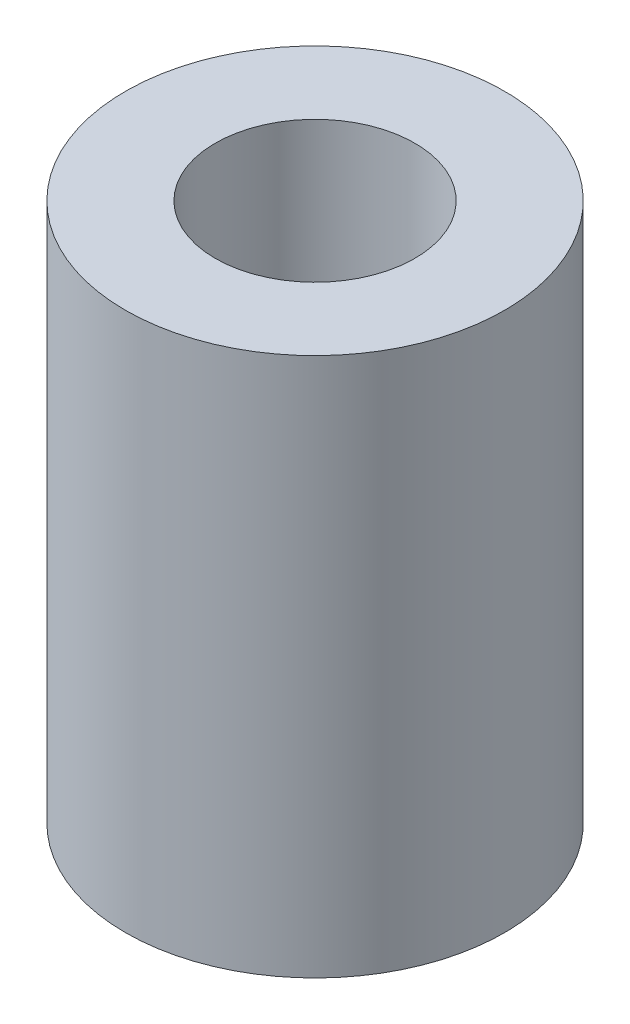
ISO-10303-21;
HEADER;
FILE_DESCRIPTION(('STEP AP214'),'2;1');
FILE_NAME('part.step','',(''),(''),'','','');
FILE_SCHEMA(('AUTOMOTIVE_DESIGN { 1 0 10303 214 1 1 1 1 }'));
ENDSEC;
DATA;
#1=APPLICATION_CONTEXT('core data for automotive mechanical design processes');
#2=APPLICATION_PROTOCOL_DEFINITION('international standard','automotive_design',2000,#1);
#3=PRODUCT_CONTEXT('',#1,'mechanical');
#4=PRODUCT('Part','Part','',(#3));
#5=PRODUCT_RELATED_PRODUCT_CATEGORY('part','',(#4));
#6=PRODUCT_DEFINITION_FORMATION('','',#4);
#7=PRODUCT_DEFINITION_CONTEXT('part definition',#1,'design');
#8=PRODUCT_DEFINITION('design','',#6,#7);
#9=PRODUCT_DEFINITION_SHAPE('','',#8);
#10=(LENGTH_UNIT() NAMED_UNIT(*) SI_UNIT(.MILLI.,.METRE.));
#11=(NAMED_UNIT(*) PLANE_ANGLE_UNIT() SI_UNIT($,.RADIAN.));
#12=(NAMED_UNIT(*) SI_UNIT($,.STERADIAN.) SOLID_ANGLE_UNIT());
#13=UNCERTAINTY_MEASURE_WITH_UNIT(LENGTH_MEASURE(1.E-05),#10,'distance_accuracy_value','');
#14=(GEOMETRIC_REPRESENTATION_CONTEXT(3) GLOBAL_UNCERTAINTY_ASSIGNED_CONTEXT((#13)) GLOBAL_UNIT_ASSIGNED_CONTEXT((#10,
#11,#12)) REPRESENTATION_CONTEXT('',''));
#15=CARTESIAN_POINT('',(0.,0.,0.));
#16=DIRECTION('',(0.,0.,1.));
#17=DIRECTION('',(1.,0.,0.));
#18=AXIS2_PLACEMENT_3D('',#15,#16,#17);
#19=CARTESIAN_POINT('',(0.,13.5,0.));
#20=DIRECTION('',(0.,-1.,0.));
#21=DIRECTION('',(0.,0.,-1.));
#22=AXIS2_PLACEMENT_3D('',#19,#20,#21);
#23=CYLINDRICAL_SURFACE('',#22,4.75);
#24=CARTESIAN_POINT('',(0.,13.5,0.));
#25=DIRECTION('',(0.,1.,0.));
#26=DIRECTION('',(0.,0.,1.));
#27=AXIS2_PLACEMENT_3D('',#24,#25,#26);
#28=CIRCLE('',#27,4.75);
#29=CARTESIAN_POINT('',(0.,13.5,4.75));
#30=VERTEX_POINT('',#29);
#31=EDGE_CURVE('E10',#30,#30,#28,.T.);
#32=ORIENTED_EDGE('',*,*,#31,.F.);
#33=EDGE_LOOP('',(#32));
#34=FACE_BOUND('',#33,.T.);
#35=CARTESIAN_POINT('',(0.,0.,0.));
#36=DIRECTION('',(0.,1.,0.));
#37=DIRECTION('',(0.,0.,1.));
#38=AXIS2_PLACEMENT_3D('',#35,#36,#37);
#39=CIRCLE('',#38,4.75);
#40=CARTESIAN_POINT('',(0.,0.,4.75));
#41=VERTEX_POINT('',#40);
#42=EDGE_CURVE('E38',#41,#41,#39,.T.);
#43=ORIENTED_EDGE('',*,*,#42,.T.);
#44=EDGE_LOOP('',(#43));
#45=FACE_BOUND('',#44,.T.);
#46=ADVANCED_FACE('F35',(#34,#45),#23,.T.);
#47=CARTESIAN_POINT('',(0.,13.5,0.));
#48=DIRECTION('',(0.,1.,0.));
#49=DIRECTION('',(0.,0.,1.));
#50=AXIS2_PLACEMENT_3D('',#47,#48,#49);
#51=PLANE('',#50);
#52=CARTESIAN_POINT('',(0.,13.5,0.));
#53=DIRECTION('',(0.,1.,0.));
#54=DIRECTION('',(0.,0.,1.));
#55=AXIS2_PLACEMENT_3D('',#52,#53,#54);
#56=CIRCLE('',#55,2.5);
#57=CARTESIAN_POINT('',(0.,13.5,2.5));
#58=VERTEX_POINT('',#57);
#59=EDGE_CURVE('E47',#58,#58,#56,.T.);
#60=ORIENTED_EDGE('',*,*,#59,.F.);
#61=EDGE_LOOP('',(#60));
#62=FACE_BOUND('',#61,.T.);
#63=ORIENTED_EDGE('',*,*,#31,.T.);
#64=EDGE_LOOP('',(#63));
#65=FACE_BOUND('',#64,.T.);
#66=ADVANCED_FACE('F62',(#62,#65),#51,.T.);
#67=CARTESIAN_POINT('',(0.,0.,0.));
#68=DIRECTION('',(0.,1.,0.));
#69=DIRECTION('',(0.,0.,1.));
#70=AXIS2_PLACEMENT_3D('',#67,#68,#69);
#71=PLANE('',#70);
#72=ORIENTED_EDGE('',*,*,#42,.F.);
#73=EDGE_LOOP('',(#72));
#74=FACE_BOUND('',#73,.T.);
#75=ADVANCED_FACE('F58',(#74),#71,.F.);
#76=CARTESIAN_POINT('',(0.,6.5,0.));
#77=DIRECTION('',(0.,1.,0.));
#78=DIRECTION('',(0.,0.,1.));
#79=AXIS2_PLACEMENT_3D('',#76,#77,#78);
#80=CYLINDRICAL_SURFACE('',#79,2.5);
#81=CARTESIAN_POINT('',(0.,6.5,0.));
#82=DIRECTION('',(0.,1.,0.));
#83=DIRECTION('',(0.,0.,1.));
#84=AXIS2_PLACEMENT_3D('',#81,#82,#83);
#85=CIRCLE('',#84,2.5);
#86=CARTESIAN_POINT('',(0.,6.5,2.5));
#87=VERTEX_POINT('',#86);
#88=EDGE_CURVE('E45',#87,#87,#85,.T.);
#89=ORIENTED_EDGE('',*,*,#88,.F.);
#90=EDGE_LOOP('',(#89));
#91=FACE_BOUND('',#90,.T.);
#92=ORIENTED_EDGE('',*,*,#59,.T.);
#93=EDGE_LOOP('',(#92));
#94=FACE_BOUND('',#93,.T.);
#95=ADVANCED_FACE('F55',(#91,#94),#80,.F.);
#96=CARTESIAN_POINT('',(0.,6.5,0.));
#97=DIRECTION('',(0.,1.,0.));
#98=DIRECTION('',(0.,0.,1.));
#99=AXIS2_PLACEMENT_3D('',#96,#97,#98);
#100=PLANE('',#99);
#101=ORIENTED_EDGE('',*,*,#88,.T.);
#102=EDGE_LOOP('',(#101));
#103=FACE_BOUND('',#102,.T.);
#104=ADVANCED_FACE('F53',(#103),#100,.T.);
#105=CLOSED_SHELL('',(#46,#66,#75,#95,#104));
#106=MANIFOLD_SOLID_BREP('B2',#105);
#107=ADVANCED_BREP_SHAPE_REPRESENTATION('',(#18,#106),#14);
#108=SHAPE_DEFINITION_REPRESENTATION(#9,#107);
ENDSEC;
END-ISO-10303-21;
